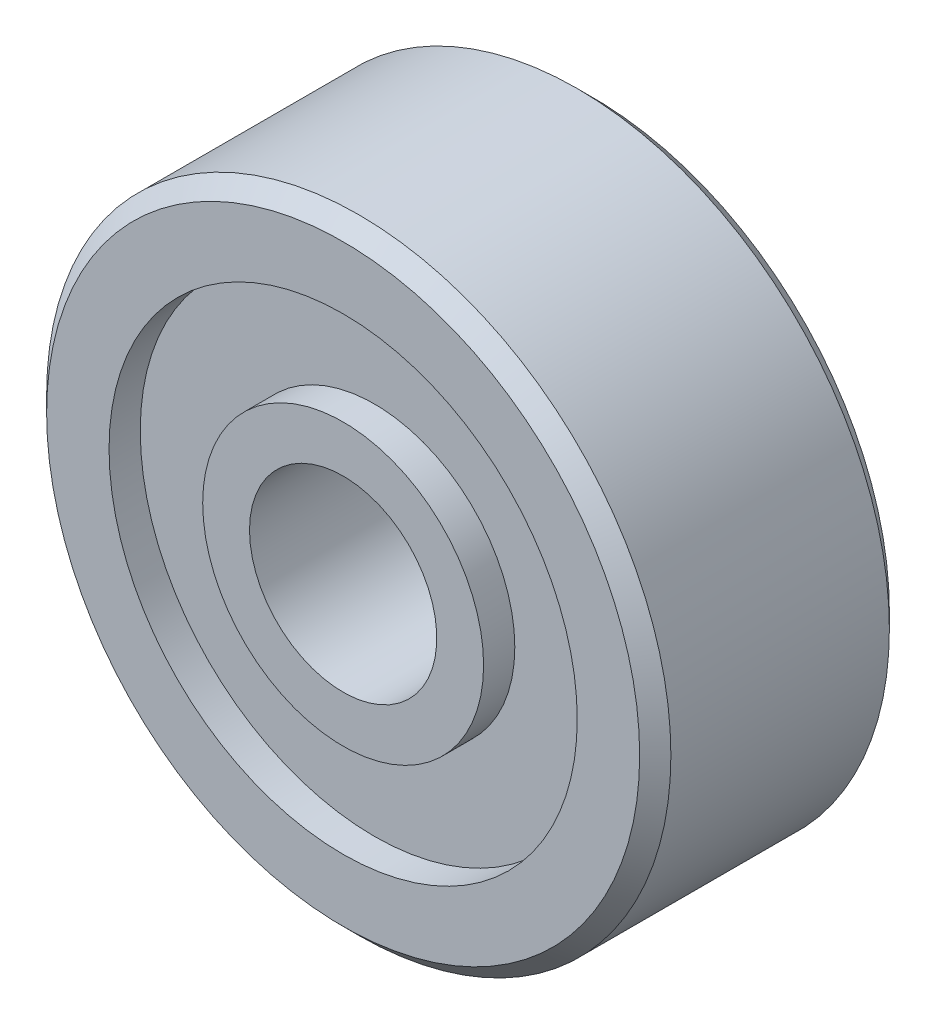
ISO-10303-21;
HEADER;
FILE_DESCRIPTION(('STEP AP214'),'2;1');
FILE_NAME('part.step','',(''),(''),'','','');
FILE_SCHEMA(('AUTOMOTIVE_DESIGN { 1 0 10303 214 1 1 1 1 }'));
ENDSEC;
DATA;
#1=APPLICATION_CONTEXT('core data for automotive mechanical design processes');
#2=APPLICATION_PROTOCOL_DEFINITION('international standard','automotive_design',2000,#1);
#3=PRODUCT_CONTEXT('',#1,'mechanical');
#4=PRODUCT('Part','Part','',(#3));
#5=PRODUCT_RELATED_PRODUCT_CATEGORY('part','',(#4));
#6=PRODUCT_DEFINITION_FORMATION('','',#4);
#7=PRODUCT_DEFINITION_CONTEXT('part definition',#1,'design');
#8=PRODUCT_DEFINITION('design','',#6,#7);
#9=PRODUCT_DEFINITION_SHAPE('','',#8);
#10=(LENGTH_UNIT() NAMED_UNIT(*) SI_UNIT(.MILLI.,.METRE.));
#11=(NAMED_UNIT(*) PLANE_ANGLE_UNIT() SI_UNIT($,.RADIAN.));
#12=(NAMED_UNIT(*) SI_UNIT($,.STERADIAN.) SOLID_ANGLE_UNIT());
#13=UNCERTAINTY_MEASURE_WITH_UNIT(LENGTH_MEASURE(1.E-05),#10,'distance_accuracy_value','');
#14=(GEOMETRIC_REPRESENTATION_CONTEXT(3) GLOBAL_UNCERTAINTY_ASSIGNED_CONTEXT((#13)) GLOBAL_UNIT_ASSIGNED_CONTEXT((#10,
#11,#12)) REPRESENTATION_CONTEXT('',''));
#15=CARTESIAN_POINT('',(0.,0.,0.));
#16=DIRECTION('',(0.,0.,1.));
#17=DIRECTION('',(1.,0.,0.));
#18=AXIS2_PLACEMENT_3D('',#15,#16,#17);
#19=CARTESIAN_POINT('',(1.5,0.,2.5));
#20=DIRECTION('',(0.,0.,-1.));
#21=DIRECTION('',(-1.,0.,0.));
#22=AXIS2_PLACEMENT_3D('',#19,#20,#21);
#23=CYLINDRICAL_SURFACE('',#22,5.);
#24=CARTESIAN_POINT('',(1.5,0.,1.25));
#25=DIRECTION('',(0.,0.,-1.));
#26=DIRECTION('',(-1.,0.,0.));
#27=AXIS2_PLACEMENT_3D('',#24,#25,#26);
#28=CIRCLE('',#27,5.);
#29=CARTESIAN_POINT('',(-3.5,0.,1.25));
#30=VERTEX_POINT('',#29);
#31=EDGE_CURVE('E10',#30,#30,#28,.T.);
#32=ORIENTED_EDGE('',*,*,#31,.T.);
#33=EDGE_LOOP('',(#32));
#34=FACE_BOUND('',#33,.T.);
#35=CARTESIAN_POINT('',(1.5,0.,-2.25));
#36=DIRECTION('',(0.,0.,-1.));
#37=DIRECTION('',(-1.,0.,0.));
#38=AXIS2_PLACEMENT_3D('',#35,#36,#37);
#39=CIRCLE('',#38,5.);
#40=CARTESIAN_POINT('',(-3.5,0.,-2.25));
#41=VERTEX_POINT('',#40);
#42=EDGE_CURVE('E76',#41,#41,#39,.T.);
#43=ORIENTED_EDGE('',*,*,#42,.F.);
#44=EDGE_LOOP('',(#43));
#45=FACE_BOUND('',#44,.T.);
#46=ADVANCED_FACE('F30',(#34,#45),#23,.T.);
#47=CARTESIAN_POINT('',(1.5,0.,1.25));
#48=DIRECTION('',(0.,0.,-1.));
#49=DIRECTION('',(-1.,0.,0.));
#50=AXIS2_PLACEMENT_3D('',#47,#48,#49);
#51=CONICAL_SURFACE('',#50,5.,0.785398163397459);
#52=CARTESIAN_POINT('',(1.5,0.,1.5));
#53=DIRECTION('',(0.,0.,-1.));
#54=DIRECTION('',(-1.,0.,0.));
#55=AXIS2_PLACEMENT_3D('',#52,#53,#54);
#56=CIRCLE('',#55,4.75);
#57=CARTESIAN_POINT('',(-3.25,0.,1.5));
#58=VERTEX_POINT('',#57);
#59=EDGE_CURVE('E36',#58,#58,#56,.T.);
#60=ORIENTED_EDGE('',*,*,#59,.T.);
#61=EDGE_LOOP('',(#60));
#62=FACE_BOUND('',#61,.T.);
#63=ORIENTED_EDGE('',*,*,#31,.F.);
#64=EDGE_LOOP('',(#63));
#65=FACE_BOUND('',#64,.T.);
#66=ADVANCED_FACE('F84',(#62,#65),#51,.T.);
#67=CARTESIAN_POINT('',(6.25,0.,1.5));
#68=DIRECTION('',(0.,0.,1.));
#69=DIRECTION('',(1.,0.,0.));
#70=AXIS2_PLACEMENT_3D('',#67,#68,#69);
#71=PLANE('',#70);
#72=CARTESIAN_POINT('',(1.5,0.,1.5));
#73=DIRECTION('',(0.,0.,-1.));
#74=DIRECTION('',(-1.,0.,0.));
#75=AXIS2_PLACEMENT_3D('',#72,#73,#74);
#76=CIRCLE('',#75,3.75);
#77=CARTESIAN_POINT('',(-2.25,0.,1.5));
#78=VERTEX_POINT('',#77);
#79=EDGE_CURVE('E40',#78,#78,#76,.T.);
#80=ORIENTED_EDGE('',*,*,#79,.T.);
#81=EDGE_LOOP('',(#80));
#82=FACE_BOUND('',#81,.T.);
#83=ORIENTED_EDGE('',*,*,#59,.F.);
#84=EDGE_LOOP('',(#83));
#85=FACE_BOUND('',#84,.T.);
#86=ADVANCED_FACE('F88',(#82,#85),#71,.T.);
#87=CARTESIAN_POINT('',(1.5,0.,2.5));
#88=DIRECTION('',(0.,0.,-1.));
#89=DIRECTION('',(-1.,0.,0.));
#90=AXIS2_PLACEMENT_3D('',#87,#88,#89);
#91=CYLINDRICAL_SURFACE('',#90,3.75);
#92=CARTESIAN_POINT('',(1.5,0.,1.));
#93=DIRECTION('',(0.,0.,-1.));
#94=DIRECTION('',(-1.,0.,0.));
#95=AXIS2_PLACEMENT_3D('',#92,#93,#94);
#96=CIRCLE('',#95,3.75);
#97=CARTESIAN_POINT('',(-2.25,0.,0.999999999999999));
#98=VERTEX_POINT('',#97);
#99=EDGE_CURVE('E44',#98,#98,#96,.T.);
#100=ORIENTED_EDGE('',*,*,#99,.T.);
#101=EDGE_LOOP('',(#100));
#102=FACE_BOUND('',#101,.T.);
#103=ORIENTED_EDGE('',*,*,#79,.F.);
#104=EDGE_LOOP('',(#103));
#105=FACE_BOUND('',#104,.T.);
#106=ADVANCED_FACE('F92',(#102,#105),#91,.F.);
#107=CARTESIAN_POINT('',(5.25,0.,1.));
#108=DIRECTION('',(0.,0.,1.));
#109=DIRECTION('',(1.,0.,0.));
#110=AXIS2_PLACEMENT_3D('',#107,#108,#109);
#111=PLANE('',#110);
#112=CARTESIAN_POINT('',(1.5,0.,0.999999999999999));
#113=DIRECTION('',(0.,0.,-1.));
#114=DIRECTION('',(-1.,0.,0.));
#115=AXIS2_PLACEMENT_3D('',#112,#113,#114);
#116=CIRCLE('',#115,2.25);
#117=CARTESIAN_POINT('',(-0.750000000000001,0.,0.999999999999999));
#118=VERTEX_POINT('',#117);
#119=EDGE_CURVE('E49',#118,#118,#116,.T.);
#120=ORIENTED_EDGE('',*,*,#119,.T.);
#121=EDGE_LOOP('',(#120));
#122=FACE_BOUND('',#121,.T.);
#123=ORIENTED_EDGE('',*,*,#99,.F.);
#124=EDGE_LOOP('',(#123));
#125=FACE_BOUND('',#124,.T.);
#126=ADVANCED_FACE('F99',(#122,#125),#111,.T.);
#127=CARTESIAN_POINT('',(1.5,0.,2.5));
#128=DIRECTION('',(0.,0.,-1.));
#129=DIRECTION('',(-1.,0.,0.));
#130=AXIS2_PLACEMENT_3D('',#127,#128,#129);
#131=CYLINDRICAL_SURFACE('',#130,2.25);
#132=CARTESIAN_POINT('',(1.5,0.,1.5));
#133=DIRECTION('',(0.,0.,-1.));
#134=DIRECTION('',(-1.,0.,0.));
#135=AXIS2_PLACEMENT_3D('',#132,#133,#134);
#136=CIRCLE('',#135,2.25);
#137=CARTESIAN_POINT('',(-0.750000000000001,0.,1.5));
#138=VERTEX_POINT('',#137);
#139=EDGE_CURVE('E52',#138,#138,#136,.T.);
#140=ORIENTED_EDGE('',*,*,#139,.T.);
#141=EDGE_LOOP('',(#140));
#142=FACE_BOUND('',#141,.T.);
#143=ORIENTED_EDGE('',*,*,#119,.F.);
#144=EDGE_LOOP('',(#143));
#145=FACE_BOUND('',#144,.T.);
#146=ADVANCED_FACE('F103',(#142,#145),#131,.T.);
#147=CARTESIAN_POINT('',(3.75,0.,1.5));
#148=DIRECTION('',(0.,0.,1.));
#149=DIRECTION('',(1.,0.,0.));
#150=AXIS2_PLACEMENT_3D('',#147,#148,#149);
#151=PLANE('',#150);
#152=CARTESIAN_POINT('',(1.5,0.,1.5));
#153=DIRECTION('',(0.,0.,-1.));
#154=DIRECTION('',(-1.,0.,0.));
#155=AXIS2_PLACEMENT_3D('',#152,#153,#154);
#156=CIRCLE('',#155,1.5);
#157=CARTESIAN_POINT('',(0.,0.,1.5));
#158=VERTEX_POINT('',#157);
#159=EDGE_CURVE('E55',#158,#158,#156,.T.);
#160=ORIENTED_EDGE('',*,*,#159,.T.);
#161=EDGE_LOOP('',(#160));
#162=FACE_BOUND('',#161,.T.);
#163=ORIENTED_EDGE('',*,*,#139,.F.);
#164=EDGE_LOOP('',(#163));
#165=FACE_BOUND('',#164,.T.);
#166=ADVANCED_FACE('F107',(#162,#165),#151,.T.);
#167=CARTESIAN_POINT('',(1.5,0.,2.5));
#168=DIRECTION('',(0.,0.,-1.));
#169=DIRECTION('',(-1.,0.,0.));
#170=AXIS2_PLACEMENT_3D('',#167,#168,#169);
#171=CYLINDRICAL_SURFACE('',#170,1.5);
#172=CARTESIAN_POINT('',(1.5,0.,-2.5));
#173=DIRECTION('',(0.,0.,-1.));
#174=DIRECTION('',(-1.,0.,0.));
#175=AXIS2_PLACEMENT_3D('',#172,#173,#174);
#176=CIRCLE('',#175,1.5);
#177=CARTESIAN_POINT('',(0.,0.,-2.5));
#178=VERTEX_POINT('',#177);
#179=EDGE_CURVE('E58',#178,#178,#176,.T.);
#180=ORIENTED_EDGE('',*,*,#179,.T.);
#181=EDGE_LOOP('',(#180));
#182=FACE_BOUND('',#181,.T.);
#183=ORIENTED_EDGE('',*,*,#159,.F.);
#184=EDGE_LOOP('',(#183));
#185=FACE_BOUND('',#184,.T.);
#186=ADVANCED_FACE('F111',(#182,#185),#171,.F.);
#187=CARTESIAN_POINT('',(3.,0.,-2.5));
#188=DIRECTION('',(0.,0.,-1.));
#189=DIRECTION('',(-1.,0.,0.));
#190=AXIS2_PLACEMENT_3D('',#187,#188,#189);
#191=PLANE('',#190);
#192=CARTESIAN_POINT('',(1.5,0.,-2.5));
#193=DIRECTION('',(0.,0.,-1.));
#194=DIRECTION('',(-1.,0.,0.));
#195=AXIS2_PLACEMENT_3D('',#192,#193,#194);
#196=CIRCLE('',#195,2.25);
#197=CARTESIAN_POINT('',(-0.749999999999998,0.,-2.5));
#198=VERTEX_POINT('',#197);
#199=EDGE_CURVE('E61',#198,#198,#196,.T.);
#200=ORIENTED_EDGE('',*,*,#199,.T.);
#201=EDGE_LOOP('',(#200));
#202=FACE_BOUND('',#201,.T.);
#203=ORIENTED_EDGE('',*,*,#179,.F.);
#204=EDGE_LOOP('',(#203));
#205=FACE_BOUND('',#204,.T.);
#206=ADVANCED_FACE('F115',(#202,#205),#191,.T.);
#207=CARTESIAN_POINT('',(1.5,0.,2.5));
#208=DIRECTION('',(0.,0.,-1.));
#209=DIRECTION('',(-1.,0.,0.));
#210=AXIS2_PLACEMENT_3D('',#207,#208,#209);
#211=CYLINDRICAL_SURFACE('',#210,2.25);
#212=CARTESIAN_POINT('',(1.5,0.,-2.));
#213=DIRECTION('',(0.,0.,-1.));
#214=DIRECTION('',(-1.,0.,0.));
#215=AXIS2_PLACEMENT_3D('',#212,#213,#214);
#216=CIRCLE('',#215,2.25);
#217=CARTESIAN_POINT('',(-0.749999999999998,0.,-2.));
#218=VERTEX_POINT('',#217);
#219=EDGE_CURVE('E64',#218,#218,#216,.T.);
#220=ORIENTED_EDGE('',*,*,#219,.T.);
#221=EDGE_LOOP('',(#220));
#222=FACE_BOUND('',#221,.T.);
#223=ORIENTED_EDGE('',*,*,#199,.F.);
#224=EDGE_LOOP('',(#223));
#225=FACE_BOUND('',#224,.T.);
#226=ADVANCED_FACE('F119',(#222,#225),#211,.T.);
#227=CARTESIAN_POINT('',(3.75,0.,-2.));
#228=DIRECTION('',(0.,0.,-1.));
#229=DIRECTION('',(-1.,0.,0.));
#230=AXIS2_PLACEMENT_3D('',#227,#228,#229);
#231=PLANE('',#230);
#232=CARTESIAN_POINT('',(1.5,0.,-2.));
#233=DIRECTION('',(0.,0.,-1.));
#234=DIRECTION('',(-1.,0.,0.));
#235=AXIS2_PLACEMENT_3D('',#232,#233,#234);
#236=CIRCLE('',#235,3.75);
#237=CARTESIAN_POINT('',(-2.25,0.,-2.));
#238=VERTEX_POINT('',#237);
#239=EDGE_CURVE('E67',#238,#238,#236,.T.);
#240=ORIENTED_EDGE('',*,*,#239,.T.);
#241=EDGE_LOOP('',(#240));
#242=FACE_BOUND('',#241,.T.);
#243=ORIENTED_EDGE('',*,*,#219,.F.);
#244=EDGE_LOOP('',(#243));
#245=FACE_BOUND('',#244,.T.);
#246=ADVANCED_FACE('F123',(#242,#245),#231,.T.);
#247=CARTESIAN_POINT('',(1.5,0.,2.5));
#248=DIRECTION('',(0.,0.,-1.));
#249=DIRECTION('',(-1.,0.,0.));
#250=AXIS2_PLACEMENT_3D('',#247,#248,#249);
#251=CYLINDRICAL_SURFACE('',#250,3.75);
#252=CARTESIAN_POINT('',(1.5,0.,-2.5));
#253=DIRECTION('',(0.,0.,-1.));
#254=DIRECTION('',(-1.,0.,0.));
#255=AXIS2_PLACEMENT_3D('',#252,#253,#254);
#256=CIRCLE('',#255,3.75);
#257=CARTESIAN_POINT('',(-2.25,0.,-2.5));
#258=VERTEX_POINT('',#257);
#259=EDGE_CURVE('E70',#258,#258,#256,.T.);
#260=ORIENTED_EDGE('',*,*,#259,.T.);
#261=EDGE_LOOP('',(#260));
#262=FACE_BOUND('',#261,.T.);
#263=ORIENTED_EDGE('',*,*,#239,.F.);
#264=EDGE_LOOP('',(#263));
#265=FACE_BOUND('',#264,.T.);
#266=ADVANCED_FACE('F127',(#262,#265),#251,.F.);
#267=CARTESIAN_POINT('',(5.25,0.,-2.5));
#268=DIRECTION('',(0.,0.,-1.));
#269=DIRECTION('',(-1.,0.,0.));
#270=AXIS2_PLACEMENT_3D('',#267,#268,#269);
#271=PLANE('',#270);
#272=CARTESIAN_POINT('',(1.5,0.,-2.5));
#273=DIRECTION('',(0.,0.,-1.));
#274=DIRECTION('',(-1.,0.,0.));
#275=AXIS2_PLACEMENT_3D('',#272,#273,#274);
#276=CIRCLE('',#275,4.75);
#277=CARTESIAN_POINT('',(-3.25,0.,-2.5));
#278=VERTEX_POINT('',#277);
#279=EDGE_CURVE('E73',#278,#278,#276,.T.);
#280=ORIENTED_EDGE('',*,*,#279,.T.);
#281=EDGE_LOOP('',(#280));
#282=FACE_BOUND('',#281,.T.);
#283=ORIENTED_EDGE('',*,*,#259,.F.);
#284=EDGE_LOOP('',(#283));
#285=FACE_BOUND('',#284,.T.);
#286=ADVANCED_FACE('F131',(#282,#285),#271,.T.);
#287=CARTESIAN_POINT('',(1.5,0.,-2.5));
#288=DIRECTION('',(0.,0.,1.));
#289=DIRECTION('',(1.,0.,0.));
#290=AXIS2_PLACEMENT_3D('',#287,#288,#289);
#291=CONICAL_SURFACE('',#290,4.75,0.785398163397453);
#292=ORIENTED_EDGE('',*,*,#42,.T.);
#293=EDGE_LOOP('',(#292));
#294=FACE_BOUND('',#293,.T.);
#295=ORIENTED_EDGE('',*,*,#279,.F.);
#296=EDGE_LOOP('',(#295));
#297=FACE_BOUND('',#296,.T.);
#298=ADVANCED_FACE('F80',(#294,#297),#291,.T.);
#299=CLOSED_SHELL('',(#46,#66,#86,#106,#126,#146,#166,#186,#206,#226,#246,#266,#286,#298));
#300=MANIFOLD_SOLID_BREP('B2',#299);
#301=ADVANCED_BREP_SHAPE_REPRESENTATION('',(#18,#300),#14);
#302=SHAPE_DEFINITION_REPRESENTATION(#9,#301);
ENDSEC;
END-ISO-10303-21;
